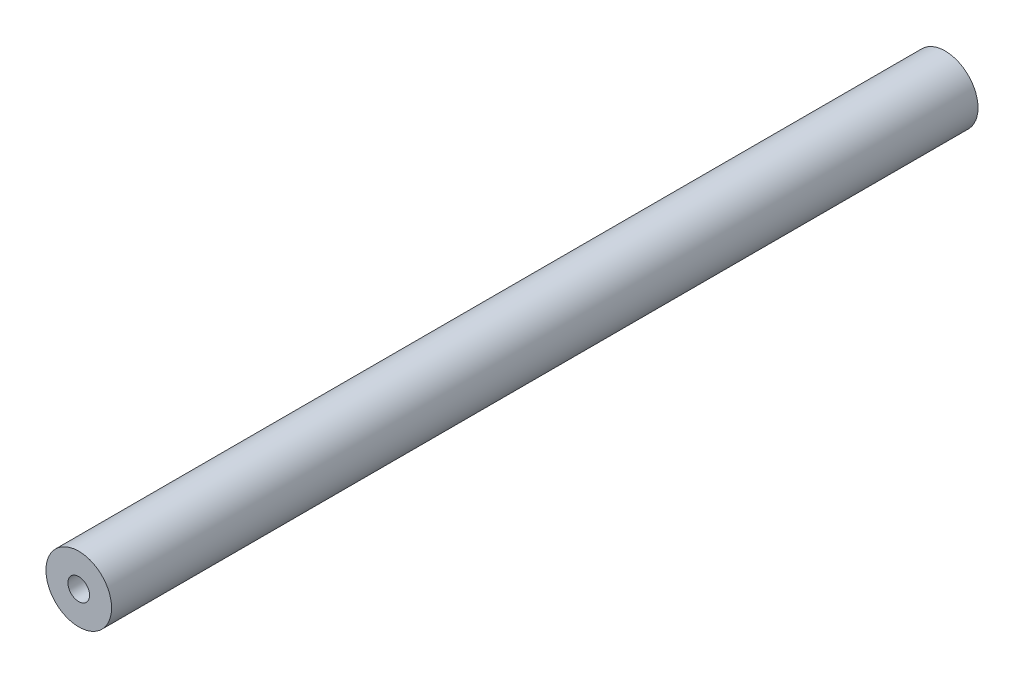
ISO-10303-21;
HEADER;
FILE_DESCRIPTION(('STEP AP214'),'2;1');
FILE_NAME('part.step','',(''),(''),'','','');
FILE_SCHEMA(('AUTOMOTIVE_DESIGN { 1 0 10303 214 1 1 1 1 }'));
ENDSEC;
DATA;
#1=APPLICATION_CONTEXT('core data for automotive mechanical design processes');
#2=APPLICATION_PROTOCOL_DEFINITION('international standard','automotive_design',2000,#1);
#3=PRODUCT_CONTEXT('',#1,'mechanical');
#4=PRODUCT('Part','Part','',(#3));
#5=PRODUCT_RELATED_PRODUCT_CATEGORY('part','',(#4));
#6=PRODUCT_DEFINITION_FORMATION('','',#4);
#7=PRODUCT_DEFINITION_CONTEXT('part definition',#1,'design');
#8=PRODUCT_DEFINITION('design','',#6,#7);
#9=PRODUCT_DEFINITION_SHAPE('','',#8);
#10=(LENGTH_UNIT() NAMED_UNIT(*) SI_UNIT(.MILLI.,.METRE.));
#11=(NAMED_UNIT(*) PLANE_ANGLE_UNIT() SI_UNIT($,.RADIAN.));
#12=(NAMED_UNIT(*) SI_UNIT($,.STERADIAN.) SOLID_ANGLE_UNIT());
#13=UNCERTAINTY_MEASURE_WITH_UNIT(LENGTH_MEASURE(1.E-05),#10,'distance_accuracy_value','');
#14=(GEOMETRIC_REPRESENTATION_CONTEXT(3) GLOBAL_UNCERTAINTY_ASSIGNED_CONTEXT((#13)) GLOBAL_UNIT_ASSIGNED_CONTEXT((#10,
#11,#12)) REPRESENTATION_CONTEXT('',''));
#15=CARTESIAN_POINT('',(0.,0.,0.));
#16=DIRECTION('',(0.,0.,1.));
#17=DIRECTION('',(1.,0.,0.));
#18=AXIS2_PLACEMENT_3D('',#15,#16,#17);
#19=CARTESIAN_POINT('',(0.,0.,1000.));
#20=DIRECTION('',(0.,0.,1.));
#21=DIRECTION('',(1.,0.,0.));
#22=AXIS2_PLACEMENT_3D('',#19,#20,#21);
#23=PLANE('',#22);
#24=CARTESIAN_POINT('',(0.,0.,1000.));
#25=DIRECTION('',(0.,0.,1.));
#26=DIRECTION('',(1.,0.,0.));
#27=AXIS2_PLACEMENT_3D('',#24,#25,#26);
#28=CIRCLE('',#27,37.875);
#29=CARTESIAN_POINT('',(37.875,0.,1000.));
#30=VERTEX_POINT('',#29);
#31=EDGE_CURVE('E11',#30,#30,#28,.T.);
#32=ORIENTED_EDGE('',*,*,#31,.T.);
#33=EDGE_LOOP('',(#32));
#34=FACE_BOUND('',#33,.T.);
#35=CARTESIAN_POINT('',(0.,0.,1000.));
#36=DIRECTION('',(0.,0.,1.));
#37=DIRECTION('',(1.,0.,0.));
#38=AXIS2_PLACEMENT_3D('',#35,#36,#37);
#39=CIRCLE('',#38,12.5);
#40=CARTESIAN_POINT('',(12.5,0.,1000.));
#41=VERTEX_POINT('',#40);
#42=EDGE_CURVE('E55',#41,#41,#39,.T.);
#43=ORIENTED_EDGE('',*,*,#42,.F.);
#44=EDGE_LOOP('',(#43));
#45=FACE_BOUND('',#44,.T.);
#46=ADVANCED_FACE('F41',(#34,#45),#23,.T.);
#47=CARTESIAN_POINT('',(0.,0.,0.));
#48=DIRECTION('',(0.,0.,1.));
#49=DIRECTION('',(1.,0.,0.));
#50=AXIS2_PLACEMENT_3D('',#47,#48,#49);
#51=PLANE('',#50);
#52=CARTESIAN_POINT('',(0.,0.,0.));
#53=DIRECTION('',(0.,0.,1.));
#54=DIRECTION('',(1.,0.,0.));
#55=AXIS2_PLACEMENT_3D('',#52,#53,#54);
#56=CIRCLE('',#55,37.875);
#57=CARTESIAN_POINT('',(37.875,0.,0.));
#58=VERTEX_POINT('',#57);
#59=EDGE_CURVE('E45',#58,#58,#56,.T.);
#60=ORIENTED_EDGE('',*,*,#59,.F.);
#61=EDGE_LOOP('',(#60));
#62=FACE_BOUND('',#61,.T.);
#63=CARTESIAN_POINT('',(0.,0.,0.));
#64=DIRECTION('',(0.,0.,1.));
#65=DIRECTION('',(1.,0.,0.));
#66=AXIS2_PLACEMENT_3D('',#63,#64,#65);
#67=CIRCLE('',#66,12.5);
#68=CARTESIAN_POINT('',(12.5,0.,0.));
#69=VERTEX_POINT('',#68);
#70=EDGE_CURVE('E58',#69,#69,#67,.T.);
#71=ORIENTED_EDGE('',*,*,#70,.T.);
#72=EDGE_LOOP('',(#71));
#73=FACE_BOUND('',#72,.T.);
#74=ADVANCED_FACE('F70',(#62,#73),#51,.F.);
#75=CARTESIAN_POINT('',(0.,0.,1000.));
#76=DIRECTION('',(0.,0.,-1.));
#77=DIRECTION('',(-1.,0.,0.));
#78=AXIS2_PLACEMENT_3D('',#75,#76,#77);
#79=CYLINDRICAL_SURFACE('',#78,37.875);
#80=ORIENTED_EDGE('',*,*,#31,.F.);
#81=EDGE_LOOP('',(#80));
#82=FACE_BOUND('',#81,.T.);
#83=ORIENTED_EDGE('',*,*,#59,.T.);
#84=EDGE_LOOP('',(#83));
#85=FACE_BOUND('',#84,.T.);
#86=ADVANCED_FACE('F43',(#82,#85),#79,.T.);
#87=CARTESIAN_POINT('',(0.,0.,1000.));
#88=DIRECTION('',(0.,0.,-1.));
#89=DIRECTION('',(-1.,0.,0.));
#90=AXIS2_PLACEMENT_3D('',#87,#88,#89);
#91=CYLINDRICAL_SURFACE('',#90,12.5);
#92=ORIENTED_EDGE('',*,*,#42,.T.);
#93=EDGE_LOOP('',(#92));
#94=FACE_BOUND('',#93,.T.);
#95=ORIENTED_EDGE('',*,*,#70,.F.);
#96=EDGE_LOOP('',(#95));
#97=FACE_BOUND('',#96,.T.);
#98=ADVANCED_FACE('F72',(#94,#97),#91,.F.);
#99=CLOSED_SHELL('',(#46,#74,#86,#98));
#100=MANIFOLD_SOLID_BREP('B2',#99);
#101=ADVANCED_BREP_SHAPE_REPRESENTATION('',(#18,#100),#14);
#102=SHAPE_DEFINITION_REPRESENTATION(#9,#101);
ENDSEC;
END-ISO-10303-21;
